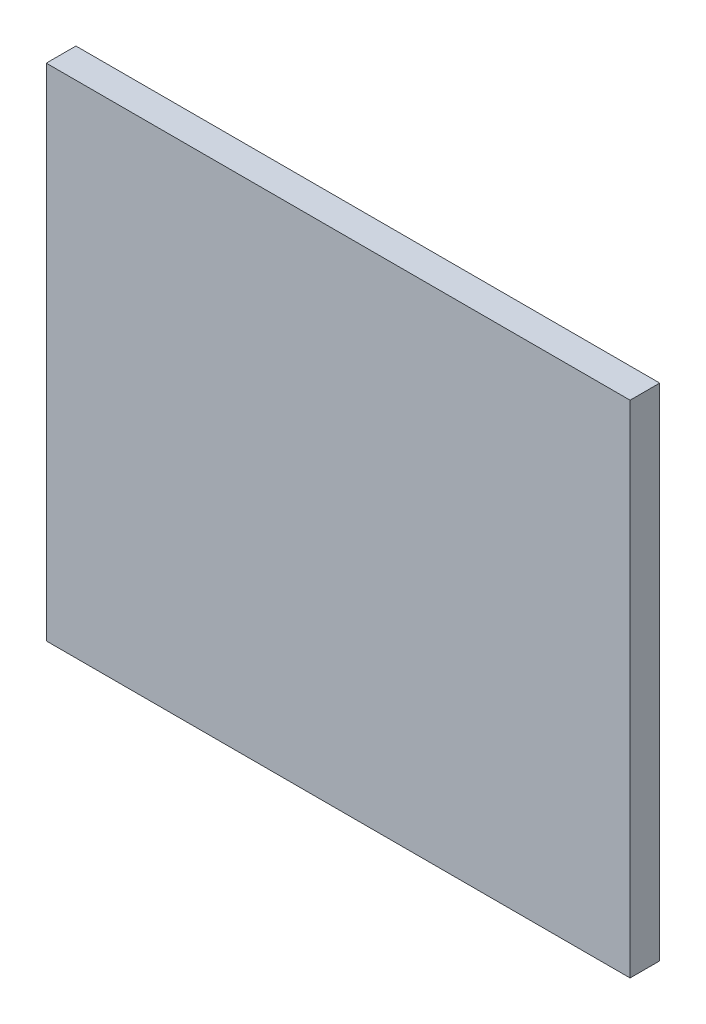
ISO-10303-21;
HEADER;
FILE_DESCRIPTION(('STEP AP214'),'2;1');
FILE_NAME('part.step','',(''),(''),'','','');
FILE_SCHEMA(('AUTOMOTIVE_DESIGN { 1 0 10303 214 1 1 1 1 }'));
ENDSEC;
DATA;
#1=APPLICATION_CONTEXT('core data for automotive mechanical design processes');
#2=APPLICATION_PROTOCOL_DEFINITION('international standard','automotive_design',2000,#1);
#3=PRODUCT_CONTEXT('',#1,'mechanical');
#4=PRODUCT('Part','Part','',(#3));
#5=PRODUCT_RELATED_PRODUCT_CATEGORY('part','',(#4));
#6=PRODUCT_DEFINITION_FORMATION('','',#4);
#7=PRODUCT_DEFINITION_CONTEXT('part definition',#1,'design');
#8=PRODUCT_DEFINITION('design','',#6,#7);
#9=PRODUCT_DEFINITION_SHAPE('','',#8);
#10=(LENGTH_UNIT() NAMED_UNIT(*) SI_UNIT(.MILLI.,.METRE.));
#11=(NAMED_UNIT(*) PLANE_ANGLE_UNIT() SI_UNIT($,.RADIAN.));
#12=(NAMED_UNIT(*) SI_UNIT($,.STERADIAN.) SOLID_ANGLE_UNIT());
#13=UNCERTAINTY_MEASURE_WITH_UNIT(LENGTH_MEASURE(1.E-05),#10,'distance_accuracy_value','');
#14=(GEOMETRIC_REPRESENTATION_CONTEXT(3) GLOBAL_UNCERTAINTY_ASSIGNED_CONTEXT((#13)) GLOBAL_UNIT_ASSIGNED_CONTEXT((#10,
#11,#12)) REPRESENTATION_CONTEXT('',''));
#15=CARTESIAN_POINT('',(0.,0.,0.));
#16=DIRECTION('',(0.,0.,1.));
#17=DIRECTION('',(1.,0.,0.));
#18=AXIS2_PLACEMENT_3D('',#15,#16,#17);
#19=CARTESIAN_POINT('',(99.0169982910156,85.3870010375977,0.));
#20=DIRECTION('',(0.,1.,0.));
#21=DIRECTION('',(1.,0.,0.));
#22=AXIS2_PLACEMENT_3D('',#19,#20,#21);
#23=PLANE('',#22);
#24=DIRECTION('',(1.,0.,0.));
#25=VECTOR('',#24,1.);
#26=CARTESIAN_POINT('',(99.0169982910156,85.3870010375977,0.03556));
#27=LINE('',#26,#25);
#28=CARTESIAN_POINT('',(99.0169982910156,85.3870010375977,0.03556));
#29=VERTEX_POINT('',#28);
#30=CARTESIAN_POINT('',(99.7170028686523,85.3870010375977,0.03556));
#31=VERTEX_POINT('',#30);
#32=EDGE_CURVE('E11',#29,#31,#27,.T.);
#33=ORIENTED_EDGE('',*,*,#32,.F.);
#34=DIRECTION('',(0.,0.,1.));
#35=VECTOR('',#34,1.);
#36=CARTESIAN_POINT('',(99.0169982910156,85.3870010375977,0.));
#37=LINE('',#36,#35);
#38=CARTESIAN_POINT('',(99.0169982910156,85.3870010375977,0.));
#39=VERTEX_POINT('',#38);
#40=EDGE_CURVE('E24',#39,#29,#37,.T.);
#41=ORIENTED_EDGE('',*,*,#40,.F.);
#42=DIRECTION('',(1.,0.,0.));
#43=VECTOR('',#42,1.);
#44=CARTESIAN_POINT('',(99.0169982910156,85.3870010375977,0.));
#45=LINE('',#44,#43);
#46=CARTESIAN_POINT('',(99.7170028686523,85.3870010375977,0.));
#47=VERTEX_POINT('',#46);
#48=EDGE_CURVE('E75',#39,#47,#45,.T.);
#49=ORIENTED_EDGE('',*,*,#48,.T.);
#50=DIRECTION('',(0.,0.,1.));
#51=VECTOR('',#50,1.);
#52=CARTESIAN_POINT('',(99.7170028686523,85.3870010375977,0.));
#53=LINE('',#52,#51);
#54=EDGE_CURVE('E37',#47,#31,#53,.T.);
#55=ORIENTED_EDGE('',*,*,#54,.T.);
#56=EDGE_LOOP('',(#33,#41,#49,#55));
#57=FACE_BOUND('',#56,.T.);
#58=ADVANCED_FACE('F17',(#57),#23,.F.);
#59=CARTESIAN_POINT('',(99.7170028686523,85.3870010375977,0.));
#60=DIRECTION('',(-1.,0.,0.));
#61=DIRECTION('',(0.,1.,0.));
#62=AXIS2_PLACEMENT_3D('',#59,#60,#61);
#63=PLANE('',#62);
#64=DIRECTION('',(0.,1.,0.));
#65=VECTOR('',#64,1.);
#66=CARTESIAN_POINT('',(99.7170028686523,85.3870010375977,0.03556));
#67=LINE('',#66,#65);
#68=CARTESIAN_POINT('',(99.7170028686523,85.9869995117188,0.03556));
#69=VERTEX_POINT('',#68);
#70=EDGE_CURVE('E83',#31,#69,#67,.T.);
#71=ORIENTED_EDGE('',*,*,#70,.F.);
#72=ORIENTED_EDGE('',*,*,#54,.F.);
#73=DIRECTION('',(0.,1.,0.));
#74=VECTOR('',#73,1.);
#75=CARTESIAN_POINT('',(99.7170028686523,85.3870010375977,0.));
#76=LINE('',#75,#74);
#77=CARTESIAN_POINT('',(99.7170028686523,85.9869995117188,0.));
#78=VERTEX_POINT('',#77);
#79=EDGE_CURVE('E81',#47,#78,#76,.T.);
#80=ORIENTED_EDGE('',*,*,#79,.T.);
#81=DIRECTION('',(0.,0.,1.));
#82=VECTOR('',#81,1.);
#83=CARTESIAN_POINT('',(99.7170028686523,85.9869995117188,0.));
#84=LINE('',#83,#82);
#85=EDGE_CURVE('E67',#78,#69,#84,.T.);
#86=ORIENTED_EDGE('',*,*,#85,.T.);
#87=EDGE_LOOP('',(#71,#72,#80,#86));
#88=FACE_BOUND('',#87,.T.);
#89=ADVANCED_FACE('F89',(#88),#63,.F.);
#90=CARTESIAN_POINT('',(99.7170028686523,85.9869995117188,0.));
#91=DIRECTION('',(0.,-1.,0.));
#92=DIRECTION('',(-1.,0.,0.));
#93=AXIS2_PLACEMENT_3D('',#90,#91,#92);
#94=PLANE('',#93);
#95=DIRECTION('',(-1.,0.,0.));
#96=VECTOR('',#95,1.);
#97=CARTESIAN_POINT('',(99.7170028686523,85.9869995117188,0.03556));
#98=LINE('',#97,#96);
#99=CARTESIAN_POINT('',(99.0169982910156,85.9869995117188,0.03556));
#100=VERTEX_POINT('',#99);
#101=EDGE_CURVE('E71',#69,#100,#98,.T.);
#102=ORIENTED_EDGE('',*,*,#101,.F.);
#103=ORIENTED_EDGE('',*,*,#85,.F.);
#104=DIRECTION('',(-1.,0.,0.));
#105=VECTOR('',#104,1.);
#106=CARTESIAN_POINT('',(99.7170028686523,85.9869995117188,0.));
#107=LINE('',#106,#105);
#108=CARTESIAN_POINT('',(99.0169982910156,85.9869995117188,0.));
#109=VERTEX_POINT('',#108);
#110=EDGE_CURVE('E63',#78,#109,#107,.T.);
#111=ORIENTED_EDGE('',*,*,#110,.T.);
#112=DIRECTION('',(0.,0.,1.));
#113=VECTOR('',#112,1.);
#114=CARTESIAN_POINT('',(99.0169982910156,85.9869995117188,0.));
#115=LINE('',#114,#113);
#116=EDGE_CURVE('E53',#109,#100,#115,.T.);
#117=ORIENTED_EDGE('',*,*,#116,.T.);
#118=EDGE_LOOP('',(#102,#103,#111,#117));
#119=FACE_BOUND('',#118,.T.);
#120=ADVANCED_FACE('F66',(#119),#94,.F.);
#121=CARTESIAN_POINT('',(99.0169982910156,85.9869995117188,0.));
#122=DIRECTION('',(1.,0.,0.));
#123=DIRECTION('',(0.,-1.,0.));
#124=AXIS2_PLACEMENT_3D('',#121,#122,#123);
#125=PLANE('',#124);
#126=DIRECTION('',(0.,-1.,0.));
#127=VECTOR('',#126,1.);
#128=CARTESIAN_POINT('',(99.0169982910156,85.9869995117188,0.03556));
#129=LINE('',#128,#127);
#130=EDGE_CURVE('E59',#100,#29,#129,.T.);
#131=ORIENTED_EDGE('',*,*,#130,.F.);
#132=ORIENTED_EDGE('',*,*,#116,.F.);
#133=DIRECTION('',(0.,-1.,0.));
#134=VECTOR('',#133,1.);
#135=CARTESIAN_POINT('',(99.0169982910156,85.9869995117188,0.));
#136=LINE('',#135,#134);
#137=EDGE_CURVE('E57',#109,#39,#136,.T.);
#138=ORIENTED_EDGE('',*,*,#137,.T.);
#139=ORIENTED_EDGE('',*,*,#40,.T.);
#140=EDGE_LOOP('',(#131,#132,#138,#139));
#141=FACE_BOUND('',#140,.T.);
#142=ADVANCED_FACE('F55',(#141),#125,.F.);
#143=CARTESIAN_POINT('',(99.0169982910156,85.3870010375977,0.));
#144=DIRECTION('',(0.,0.,-1.));
#145=DIRECTION('',(-1.,0.,0.));
#146=AXIS2_PLACEMENT_3D('',#143,#144,#145);
#147=PLANE('',#146);
#148=ORIENTED_EDGE('',*,*,#137,.F.);
#149=ORIENTED_EDGE('',*,*,#110,.F.);
#150=ORIENTED_EDGE('',*,*,#79,.F.);
#151=ORIENTED_EDGE('',*,*,#48,.F.);
#152=EDGE_LOOP('',(#148,#149,#150,#151));
#153=FACE_BOUND('',#152,.T.);
#154=ADVANCED_FACE('F74',(#153),#147,.T.);
#155=CARTESIAN_POINT('',(99.0169982910156,85.3870010375977,0.03556));
#156=DIRECTION('',(0.,0.,-1.));
#157=DIRECTION('',(-1.,0.,0.));
#158=AXIS2_PLACEMENT_3D('',#155,#156,#157);
#159=PLANE('',#158);
#160=ORIENTED_EDGE('',*,*,#32,.T.);
#161=ORIENTED_EDGE('',*,*,#70,.T.);
#162=ORIENTED_EDGE('',*,*,#101,.T.);
#163=ORIENTED_EDGE('',*,*,#130,.T.);
#164=EDGE_LOOP('',(#160,#161,#162,#163));
#165=FACE_BOUND('',#164,.T.);
#166=ADVANCED_FACE('F91',(#165),#159,.F.);
#167=CLOSED_SHELL('',(#58,#89,#120,#142,#154,#166));
#168=MANIFOLD_SOLID_BREP('B1',#167);
#169=ADVANCED_BREP_SHAPE_REPRESENTATION('',(#18,#168),#14);
#170=SHAPE_DEFINITION_REPRESENTATION(#9,#169);
ENDSEC;
END-ISO-10303-21;
